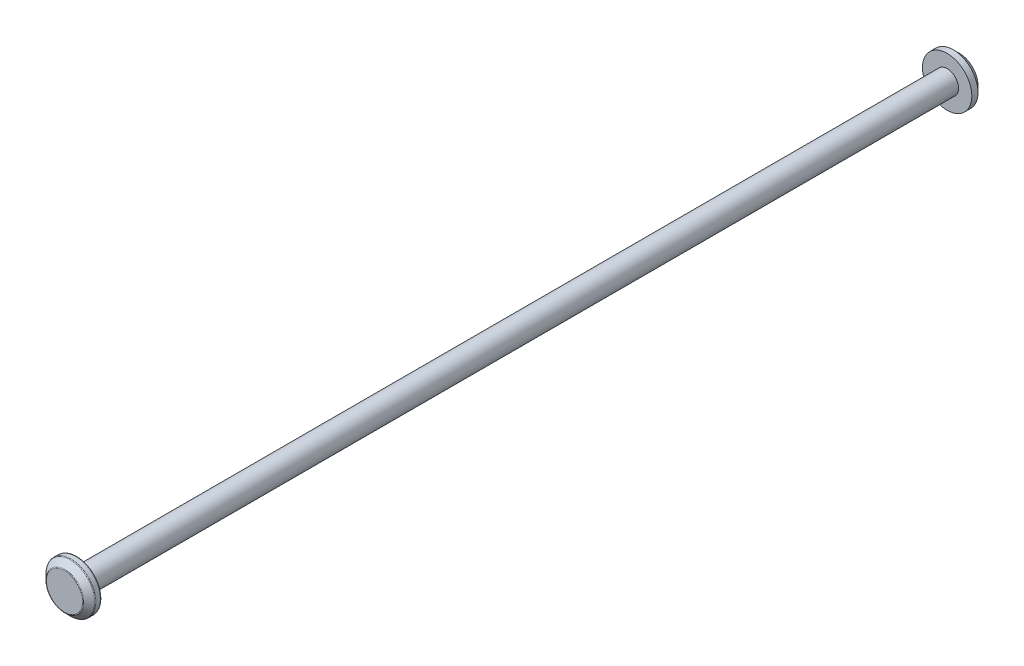
ISO-10303-21;
HEADER;
FILE_DESCRIPTION(('STEP AP214'),'2;1');
FILE_NAME('part.step','',(''),(''),'','','');
FILE_SCHEMA(('AUTOMOTIVE_DESIGN { 1 0 10303 214 1 1 1 1 }'));
ENDSEC;
DATA;
#1=APPLICATION_CONTEXT('core data for automotive mechanical design processes');
#2=APPLICATION_PROTOCOL_DEFINITION('international standard','automotive_design',2000,#1);
#3=PRODUCT_CONTEXT('',#1,'mechanical');
#4=PRODUCT('Part','Part','',(#3));
#5=PRODUCT_RELATED_PRODUCT_CATEGORY('part','',(#4));
#6=PRODUCT_DEFINITION_FORMATION('','',#4);
#7=PRODUCT_DEFINITION_CONTEXT('part definition',#1,'design');
#8=PRODUCT_DEFINITION('design','',#6,#7);
#9=PRODUCT_DEFINITION_SHAPE('','',#8);
#10=(LENGTH_UNIT() NAMED_UNIT(*) SI_UNIT(.MILLI.,.METRE.));
#11=(NAMED_UNIT(*) PLANE_ANGLE_UNIT() SI_UNIT($,.RADIAN.));
#12=(NAMED_UNIT(*) SI_UNIT($,.STERADIAN.) SOLID_ANGLE_UNIT());
#13=UNCERTAINTY_MEASURE_WITH_UNIT(LENGTH_MEASURE(1.E-05),#10,'distance_accuracy_value','');
#14=(GEOMETRIC_REPRESENTATION_CONTEXT(3) GLOBAL_UNCERTAINTY_ASSIGNED_CONTEXT((#13)) GLOBAL_UNIT_ASSIGNED_CONTEXT((#10,
#11,#12)) REPRESENTATION_CONTEXT('',''));
#15=CARTESIAN_POINT('',(0.,0.,0.));
#16=DIRECTION('',(0.,0.,1.));
#17=DIRECTION('',(1.,0.,0.));
#18=AXIS2_PLACEMENT_3D('',#15,#16,#17);
#19=CARTESIAN_POINT('',(0.,0.,176.262474264671));
#20=DIRECTION('',(0.,0.,-1.));
#21=DIRECTION('',(-1.,0.,0.));
#22=AXIS2_PLACEMENT_3D('',#19,#20,#21);
#23=CYLINDRICAL_SURFACE('',#22,4.625);
#24=CARTESIAN_POINT('',(0.,0.,175.76247426467));
#25=DIRECTION('',(0.,0.,1.));
#26=DIRECTION('',(1.,0.,0.));
#27=AXIS2_PLACEMENT_3D('',#24,#25,#26);
#28=CIRCLE('',#27,4.625);
#29=CARTESIAN_POINT('',(4.625,0.,175.76247426467));
#30=VERTEX_POINT('',#29);
#31=EDGE_CURVE('E55',#30,#30,#28,.F.);
#32=ORIENTED_EDGE('',*,*,#31,.T.);
#33=EDGE_LOOP('',(#32));
#34=FACE_BOUND('',#33,.T.);
#35=CARTESIAN_POINT('',(0.,0.,-176.237525735329));
#36=DIRECTION('',(0.,0.,1.));
#37=DIRECTION('',(1.,0.,0.));
#38=AXIS2_PLACEMENT_3D('',#35,#36,#37);
#39=CIRCLE('',#38,4.625);
#40=CARTESIAN_POINT('',(4.625,0.,-176.237525735329));
#41=VERTEX_POINT('',#40);
#42=EDGE_CURVE('E78',#41,#41,#39,.T.);
#43=ORIENTED_EDGE('',*,*,#42,.T.);
#44=EDGE_LOOP('',(#43));
#45=FACE_BOUND('',#44,.T.);
#46=ADVANCED_FACE('F40',(#34,#45),#23,.T.);
#47=CARTESIAN_POINT('',(0.,0.,181.262474264671));
#48=DIRECTION('',(0.,0.,-1.));
#49=DIRECTION('',(-1.,0.,0.));
#50=AXIS2_PLACEMENT_3D('',#47,#48,#49);
#51=CYLINDRICAL_SURFACE('',#50,10.);
#52=CARTESIAN_POINT('',(0.,0.,176.762474264671));
#53=DIRECTION('',(0.,0.,1.));
#54=DIRECTION('',(1.,0.,0.));
#55=AXIS2_PLACEMENT_3D('',#52,#53,#54);
#56=CIRCLE('',#55,10.);
#57=CARTESIAN_POINT('',(10.,0.,176.762474264671));
#58=VERTEX_POINT('',#57);
#59=EDGE_CURVE('E66',#58,#58,#56,.T.);
#60=ORIENTED_EDGE('',*,*,#59,.T.);
#61=EDGE_LOOP('',(#60));
#62=FACE_BOUND('',#61,.T.);
#63=CARTESIAN_POINT('',(0.,0.,178.555367483484));
#64=DIRECTION('',(0.,0.,1.));
#65=DIRECTION('',(1.,0.,0.));
#66=AXIS2_PLACEMENT_3D('',#63,#64,#65);
#67=CIRCLE('',#66,10.);
#68=CARTESIAN_POINT('',(10.,0.,178.555367483484));
#69=VERTEX_POINT('',#68);
#70=EDGE_CURVE('E69',#69,#69,#67,.F.);
#71=ORIENTED_EDGE('',*,*,#70,.T.);
#72=EDGE_LOOP('',(#71));
#73=FACE_BOUND('',#72,.T.);
#74=ADVANCED_FACE('F105',(#62,#73),#51,.T.);
#75=CARTESIAN_POINT('',(0.,0.,181.262474264671));
#76=DIRECTION('',(0.,0.,1.));
#77=DIRECTION('',(1.,0.,0.));
#78=AXIS2_PLACEMENT_3D('',#75,#76,#77);
#79=PLANE('',#78);
#80=CARTESIAN_POINT('',(0.,0.,181.262474264671));
#81=DIRECTION('',(0.,0.,1.));
#82=DIRECTION('',(1.,0.,0.));
#83=AXIS2_PLACEMENT_3D('',#80,#81,#82);
#84=CIRCLE('',#83,7.29289321881348);
#85=CARTESIAN_POINT('',(7.29289321881348,0.,181.262474264671));
#86=VERTEX_POINT('',#85);
#87=EDGE_CURVE('E10',#86,#86,#84,.T.);
#88=ORIENTED_EDGE('',*,*,#87,.T.);
#89=EDGE_LOOP('',(#88));
#90=FACE_BOUND('',#89,.T.);
#91=ADVANCED_FACE('F111',(#90),#79,.T.);
#92=CARTESIAN_POINT('',(0.,0.,176.262474264671));
#93=DIRECTION('',(0.,0.,1.));
#94=DIRECTION('',(1.,0.,0.));
#95=AXIS2_PLACEMENT_3D('',#92,#93,#94);
#96=PLANE('',#95);
#97=CARTESIAN_POINT('',(0.,0.,176.262474264671));
#98=DIRECTION('',(0.,0.,1.));
#99=DIRECTION('',(1.,0.,0.));
#100=AXIS2_PLACEMENT_3D('',#97,#98,#99);
#101=CIRCLE('',#100,9.5);
#102=CARTESIAN_POINT('',(9.5,0.,176.262474264671));
#103=VERTEX_POINT('',#102);
#104=EDGE_CURVE('E60',#103,#103,#101,.F.);
#105=ORIENTED_EDGE('',*,*,#104,.T.);
#106=EDGE_LOOP('',(#105));
#107=FACE_BOUND('',#106,.T.);
#108=CARTESIAN_POINT('',(0.,0.,176.262474264671));
#109=DIRECTION('',(0.,0.,1.));
#110=DIRECTION('',(1.,0.,0.));
#111=AXIS2_PLACEMENT_3D('',#108,#109,#110);
#112=CIRCLE('',#111,5.125);
#113=CARTESIAN_POINT('',(5.125,0.,176.262474264671));
#114=VERTEX_POINT('',#113);
#115=EDGE_CURVE('E63',#114,#114,#112,.T.);
#116=ORIENTED_EDGE('',*,*,#115,.T.);
#117=EDGE_LOOP('',(#116));
#118=FACE_BOUND('',#117,.T.);
#119=ADVANCED_FACE('F99',(#107,#118),#96,.F.);
#120=CARTESIAN_POINT('',(0.,0.,181.262474264671));
#121=DIRECTION('',(0.,0.,-1.));
#122=DIRECTION('',(-1.,0.,0.));
#123=AXIS2_PLACEMENT_3D('',#120,#121,#122);
#124=CONICAL_SURFACE('',#123,7.50000000000001,0.78539816339744);
#125=CARTESIAN_POINT('',(0.,0.,178.908920874077));
#126=DIRECTION('',(0.,0.,-1.));
#127=DIRECTION('',(-1.,0.,0.));
#128=AXIS2_PLACEMENT_3D('',#125,#126,#127);
#129=CIRCLE('',#128,9.85355339059328);
#130=CARTESIAN_POINT('',(-9.85355339059328,0.,178.908920874077));
#131=VERTEX_POINT('',#130);
#132=EDGE_CURVE('E47',#131,#131,#129,.F.);
#133=ORIENTED_EDGE('',*,*,#132,.T.);
#134=EDGE_LOOP('',(#133));
#135=FACE_BOUND('',#134,.T.);
#136=CARTESIAN_POINT('',(0.,0.,181.116027655264));
#137=DIRECTION('',(0.,0.,1.));
#138=DIRECTION('',(1.,0.,0.));
#139=AXIS2_PLACEMENT_3D('',#136,#137,#138);
#140=CIRCLE('',#139,7.64644660940676);
#141=CARTESIAN_POINT('',(7.64644660940676,0.,181.116027655264));
#142=VERTEX_POINT('',#141);
#143=EDGE_CURVE('E51',#142,#142,#140,.F.);
#144=ORIENTED_EDGE('',*,*,#143,.T.);
#145=EDGE_LOOP('',(#144));
#146=FACE_BOUND('',#145,.T.);
#147=ADVANCED_FACE('F90',(#135,#146),#124,.T.);
#148=CARTESIAN_POINT('',(0.,0.,-181.237525735329));
#149=DIRECTION('',(0.,0.,1.));
#150=DIRECTION('',(-1.,0.,0.));
#151=AXIS2_PLACEMENT_3D('',#148,#149,#150);
#152=CYLINDRICAL_SURFACE('',#151,10.);
#153=CARTESIAN_POINT('',(0.,0.,-178.737525735329));
#154=DIRECTION('',(0.,0.,1.));
#155=DIRECTION('',(1.,0.,0.));
#156=AXIS2_PLACEMENT_3D('',#153,#154,#155);
#157=CIRCLE('',#156,10.);
#158=CARTESIAN_POINT('',(10.,0.,-178.737525735329));
#159=VERTEX_POINT('',#158);
#160=EDGE_CURVE('E72',#159,#159,#157,.F.);
#161=ORIENTED_EDGE('',*,*,#160,.F.);
#162=EDGE_LOOP('',(#161));
#163=FACE_BOUND('',#162,.T.);
#164=CARTESIAN_POINT('',(0.,0.,-176.237525735329));
#165=DIRECTION('',(0.,0.,1.));
#166=DIRECTION('',(1.,0.,0.));
#167=AXIS2_PLACEMENT_3D('',#164,#165,#166);
#168=CIRCLE('',#167,10.);
#169=CARTESIAN_POINT('',(10.,0.,-176.237525735329));
#170=VERTEX_POINT('',#169);
#171=EDGE_CURVE('E81',#170,#170,#168,.T.);
#172=ORIENTED_EDGE('',*,*,#171,.F.);
#173=EDGE_LOOP('',(#172));
#174=FACE_BOUND('',#173,.T.);
#175=ADVANCED_FACE('F87',(#163,#174),#152,.T.);
#176=CARTESIAN_POINT('',(0.,0.,-181.237525735329));
#177=DIRECTION('',(0.,0.,-1.));
#178=DIRECTION('',(1.,0.,0.));
#179=AXIS2_PLACEMENT_3D('',#176,#177,#178);
#180=PLANE('',#179);
#181=CARTESIAN_POINT('',(0.,0.,-181.237525735329));
#182=DIRECTION('',(0.,0.,1.));
#183=DIRECTION('',(1.,0.,0.));
#184=AXIS2_PLACEMENT_3D('',#181,#182,#183);
#185=CIRCLE('',#184,7.50000000000001);
#186=CARTESIAN_POINT('',(7.50000000000001,0.,-181.237525735329));
#187=VERTEX_POINT('',#186);
#188=EDGE_CURVE('E75',#187,#187,#185,.T.);
#189=ORIENTED_EDGE('',*,*,#188,.F.);
#190=EDGE_LOOP('',(#189));
#191=FACE_BOUND('',#190,.T.);
#192=ADVANCED_FACE('F89',(#191),#180,.T.);
#193=CARTESIAN_POINT('',(0.,0.,-176.237525735329));
#194=DIRECTION('',(0.,0.,-1.));
#195=DIRECTION('',(1.,0.,0.));
#196=AXIS2_PLACEMENT_3D('',#193,#194,#195);
#197=PLANE('',#196);
#198=ORIENTED_EDGE('',*,*,#42,.F.);
#199=EDGE_LOOP('',(#198));
#200=FACE_BOUND('',#199,.T.);
#201=ORIENTED_EDGE('',*,*,#171,.T.);
#202=EDGE_LOOP('',(#201));
#203=FACE_BOUND('',#202,.T.);
#204=ADVANCED_FACE('F85',(#200,#203),#197,.F.);
#205=CARTESIAN_POINT('',(0.,0.,-181.237525735329));
#206=DIRECTION('',(0.,0.,1.));
#207=DIRECTION('',(-1.,0.,0.));
#208=AXIS2_PLACEMENT_3D('',#205,#206,#207);
#209=CONICAL_SURFACE('',#208,7.50000000000001,0.78539816339744);
#210=ORIENTED_EDGE('',*,*,#160,.T.);
#211=EDGE_LOOP('',(#210));
#212=FACE_BOUND('',#211,.T.);
#213=ORIENTED_EDGE('',*,*,#188,.T.);
#214=EDGE_LOOP('',(#213));
#215=FACE_BOUND('',#214,.T.);
#216=ADVANCED_FACE('F121',(#212,#215),#209,.T.);
#217=CARTESIAN_POINT('',(0.,0.,176.762474264671));
#218=DIRECTION('',(0.,0.,1.));
#219=DIRECTION('',(1.,0.,0.));
#220=AXIS2_PLACEMENT_3D('',#217,#218,#219);
#221=TOROIDAL_SURFACE('',#220,9.5,0.5);
#222=ORIENTED_EDGE('',*,*,#104,.F.);
#223=EDGE_LOOP('',(#222));
#224=FACE_BOUND('',#223,.T.);
#225=ORIENTED_EDGE('',*,*,#59,.F.);
#226=EDGE_LOOP('',(#225));
#227=FACE_BOUND('',#226,.T.);
#228=ADVANCED_FACE('F117',(#224,#227),#221,.T.);
#229=CARTESIAN_POINT('',(0.,0.,175.76247426467));
#230=DIRECTION('',(0.,0.,1.));
#231=DIRECTION('',(1.,0.,0.));
#232=AXIS2_PLACEMENT_3D('',#229,#230,#231);
#233=TOROIDAL_SURFACE('',#232,5.125,0.5);
#234=ORIENTED_EDGE('',*,*,#31,.F.);
#235=EDGE_LOOP('',(#234));
#236=FACE_BOUND('',#235,.T.);
#237=ORIENTED_EDGE('',*,*,#115,.F.);
#238=EDGE_LOOP('',(#237));
#239=FACE_BOUND('',#238,.T.);
#240=ADVANCED_FACE('F120',(#236,#239),#233,.F.);
#241=CARTESIAN_POINT('',(0.,0.,178.555367483484));
#242=DIRECTION('',(0.,0.,1.));
#243=DIRECTION('',(1.,0.,0.));
#244=AXIS2_PLACEMENT_3D('',#241,#242,#243);
#245=TOROIDAL_SURFACE('',#244,9.5,0.5);
#246=ORIENTED_EDGE('',*,*,#132,.F.);
#247=EDGE_LOOP('',(#246));
#248=FACE_BOUND('',#247,.T.);
#249=ORIENTED_EDGE('',*,*,#70,.F.);
#250=EDGE_LOOP('',(#249));
#251=FACE_BOUND('',#250,.T.);
#252=ADVANCED_FACE('F124',(#248,#251),#245,.T.);
#253=CARTESIAN_POINT('',(0.,0.,180.76247426467));
#254=DIRECTION('',(0.,0.,1.));
#255=DIRECTION('',(1.,0.,0.));
#256=AXIS2_PLACEMENT_3D('',#253,#254,#255);
#257=TOROIDAL_SURFACE('',#256,7.29289321881348,0.5);
#258=ORIENTED_EDGE('',*,*,#143,.F.);
#259=EDGE_LOOP('',(#258));
#260=FACE_BOUND('',#259,.T.);
#261=ORIENTED_EDGE('',*,*,#87,.F.);
#262=EDGE_LOOP('',(#261));
#263=FACE_BOUND('',#262,.T.);
#264=ADVANCED_FACE('F42',(#260,#263),#257,.T.);
#265=CLOSED_SHELL('',(#46,#74,#91,#119,#147,#175,#192,#204,#216,#228,#240,#252,#264));
#266=MANIFOLD_SOLID_BREP('B2',#265);
#267=ADVANCED_BREP_SHAPE_REPRESENTATION('',(#18,#266),#14);
#268=SHAPE_DEFINITION_REPRESENTATION(#9,#267);
ENDSEC;
END-ISO-10303-21;
